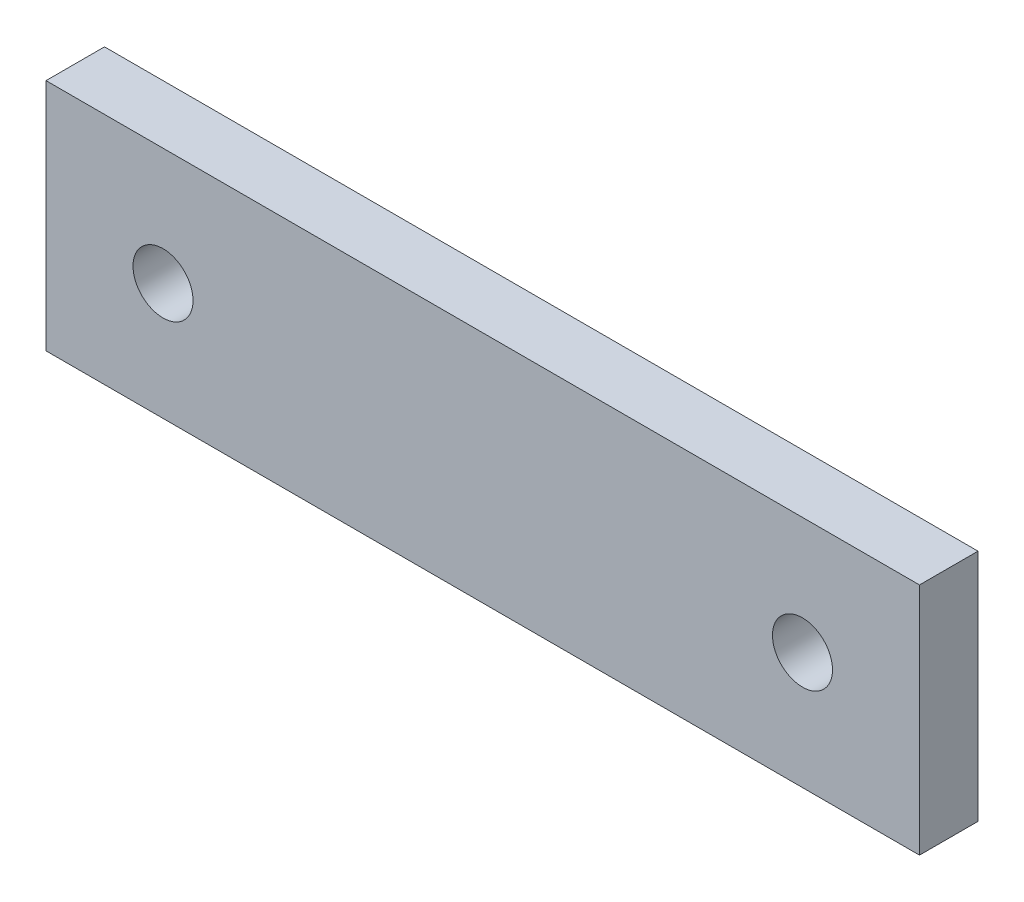
ISO-10303-21;
HEADER;
FILE_DESCRIPTION(('STEP AP214'),'2;1');
FILE_NAME('part.step','',(''),(''),'','','');
FILE_SCHEMA(('AUTOMOTIVE_DESIGN { 1 0 10303 214 1 1 1 1 }'));
ENDSEC;
DATA;
#1=APPLICATION_CONTEXT('core data for automotive mechanical design processes');
#2=APPLICATION_PROTOCOL_DEFINITION('international standard','automotive_design',2000,#1);
#3=PRODUCT_CONTEXT('',#1,'mechanical');
#4=PRODUCT('Part','Part','',(#3));
#5=PRODUCT_RELATED_PRODUCT_CATEGORY('part','',(#4));
#6=PRODUCT_DEFINITION_FORMATION('','',#4);
#7=PRODUCT_DEFINITION_CONTEXT('part definition',#1,'design');
#8=PRODUCT_DEFINITION('design','',#6,#7);
#9=PRODUCT_DEFINITION_SHAPE('','',#8);
#10=(LENGTH_UNIT() NAMED_UNIT(*) SI_UNIT(.MILLI.,.METRE.));
#11=(NAMED_UNIT(*) PLANE_ANGLE_UNIT() SI_UNIT($,.RADIAN.));
#12=(NAMED_UNIT(*) SI_UNIT($,.STERADIAN.) SOLID_ANGLE_UNIT());
#13=UNCERTAINTY_MEASURE_WITH_UNIT(LENGTH_MEASURE(1.E-05),#10,'distance_accuracy_value','');
#14=(GEOMETRIC_REPRESENTATION_CONTEXT(3) GLOBAL_UNCERTAINTY_ASSIGNED_CONTEXT((#13)) GLOBAL_UNIT_ASSIGNED_CONTEXT((#10,
#11,#12)) REPRESENTATION_CONTEXT('',''));
#15=CARTESIAN_POINT('',(0.,0.,0.));
#16=DIRECTION('',(0.,0.,1.));
#17=DIRECTION('',(1.,0.,0.));
#18=AXIS2_PLACEMENT_3D('',#15,#16,#17);
#19=CARTESIAN_POINT('',(0.,0.,6.35));
#20=DIRECTION('',(0.,0.,-1.));
#21=DIRECTION('',(-1.,0.,0.));
#22=AXIS2_PLACEMENT_3D('',#19,#20,#21);
#23=PLANE('',#22);
#24=DIRECTION('',(0.,1.,0.));
#25=VECTOR('',#24,1.);
#26=CARTESIAN_POINT('',(47.4,-12.7,6.35));
#27=LINE('',#26,#25);
#28=CARTESIAN_POINT('',(47.4,-12.7,6.35));
#29=VERTEX_POINT('',#28);
#30=CARTESIAN_POINT('',(47.4,12.7,6.35));
#31=VERTEX_POINT('',#30);
#32=EDGE_CURVE('E102',#29,#31,#27,.T.);
#33=ORIENTED_EDGE('',*,*,#32,.T.);
#34=DIRECTION('',(-1.,0.,0.));
#35=VECTOR('',#34,1.);
#36=CARTESIAN_POINT('',(-47.4,12.7,6.35));
#37=LINE('',#36,#35);
#38=CARTESIAN_POINT('',(-47.4,12.7,6.35));
#39=VERTEX_POINT('',#38);
#40=EDGE_CURVE('E97',#31,#39,#37,.T.);
#41=ORIENTED_EDGE('',*,*,#40,.T.);
#42=DIRECTION('',(0.,-1.,0.));
#43=VECTOR('',#42,1.);
#44=CARTESIAN_POINT('',(-47.4,-12.7,6.35));
#45=LINE('',#44,#43);
#46=CARTESIAN_POINT('',(-47.4,-12.7,6.35));
#47=VERTEX_POINT('',#46);
#48=EDGE_CURVE('E100',#39,#47,#45,.T.);
#49=ORIENTED_EDGE('',*,*,#48,.T.);
#50=DIRECTION('',(1.,0.,0.));
#51=VECTOR('',#50,1.);
#52=CARTESIAN_POINT('',(-47.4,-12.7,6.35));
#53=LINE('',#52,#51);
#54=EDGE_CURVE('E67',#47,#29,#53,.T.);
#55=ORIENTED_EDGE('',*,*,#54,.T.);
#56=EDGE_LOOP('',(#33,#41,#49,#55));
#57=FACE_BOUND('',#56,.T.);
#58=CARTESIAN_POINT('',(34.7,0.,6.35));
#59=DIRECTION('',(0.,0.,1.));
#60=DIRECTION('',(1.,0.,0.));
#61=AXIS2_PLACEMENT_3D('',#58,#59,#60);
#62=CIRCLE('',#61,3.25755);
#63=CARTESIAN_POINT('',(37.95755,0.,6.35));
#64=VERTEX_POINT('',#63);
#65=EDGE_CURVE('E123',#64,#64,#62,.T.);
#66=ORIENTED_EDGE('',*,*,#65,.F.);
#67=EDGE_LOOP('',(#66));
#68=FACE_BOUND('',#67,.T.);
#69=CARTESIAN_POINT('',(-34.7,0.,6.35));
#70=DIRECTION('',(0.,0.,1.));
#71=DIRECTION('',(1.,0.,0.));
#72=AXIS2_PLACEMENT_3D('',#69,#70,#71);
#73=CIRCLE('',#72,3.25755);
#74=CARTESIAN_POINT('',(-31.44245,0.,6.35));
#75=VERTEX_POINT('',#74);
#76=EDGE_CURVE('E147',#75,#75,#73,.T.);
#77=ORIENTED_EDGE('',*,*,#76,.F.);
#78=EDGE_LOOP('',(#77));
#79=FACE_BOUND('',#78,.T.);
#80=ADVANCED_FACE('F49',(#57,#68,#79),#23,.F.);
#81=CARTESIAN_POINT('',(0.,0.,0.));
#82=DIRECTION('',(0.,0.,-1.));
#83=DIRECTION('',(-1.,0.,0.));
#84=AXIS2_PLACEMENT_3D('',#81,#82,#83);
#85=PLANE('',#84);
#86=CARTESIAN_POINT('',(34.7,0.,0.));
#87=DIRECTION('',(0.,0.,1.));
#88=DIRECTION('',(1.,0.,0.));
#89=AXIS2_PLACEMENT_3D('',#86,#87,#88);
#90=CIRCLE('',#89,3.25755);
#91=CARTESIAN_POINT('',(37.95755,0.,0.));
#92=VERTEX_POINT('',#91);
#93=EDGE_CURVE('E144',#92,#92,#90,.T.);
#94=ORIENTED_EDGE('',*,*,#93,.T.);
#95=EDGE_LOOP('',(#94));
#96=FACE_BOUND('',#95,.T.);
#97=DIRECTION('',(0.,1.,0.));
#98=VECTOR('',#97,1.);
#99=CARTESIAN_POINT('',(47.4,-12.7,0.));
#100=LINE('',#99,#98);
#101=CARTESIAN_POINT('',(47.4,-12.7,0.));
#102=VERTEX_POINT('',#101);
#103=CARTESIAN_POINT('',(47.4,12.7,0.));
#104=VERTEX_POINT('',#103);
#105=EDGE_CURVE('E119',#102,#104,#100,.T.);
#106=ORIENTED_EDGE('',*,*,#105,.F.);
#107=DIRECTION('',(1.,0.,0.));
#108=VECTOR('',#107,1.);
#109=CARTESIAN_POINT('',(-47.4,-12.7,0.));
#110=LINE('',#109,#108);
#111=CARTESIAN_POINT('',(-47.4,-12.7,0.));
#112=VERTEX_POINT('',#111);
#113=EDGE_CURVE('E90',#112,#102,#110,.T.);
#114=ORIENTED_EDGE('',*,*,#113,.F.);
#115=DIRECTION('',(0.,-1.,0.));
#116=VECTOR('',#115,1.);
#117=CARTESIAN_POINT('',(-47.4,-12.7,0.));
#118=LINE('',#117,#116);
#119=CARTESIAN_POINT('',(-47.4,12.7,0.));
#120=VERTEX_POINT('',#119);
#121=EDGE_CURVE('E84',#120,#112,#118,.T.);
#122=ORIENTED_EDGE('',*,*,#121,.F.);
#123=DIRECTION('',(-1.,0.,0.));
#124=VECTOR('',#123,1.);
#125=CARTESIAN_POINT('',(-47.4,12.7,0.));
#126=LINE('',#125,#124);
#127=EDGE_CURVE('E107',#104,#120,#126,.T.);
#128=ORIENTED_EDGE('',*,*,#127,.F.);
#129=EDGE_LOOP('',(#106,#114,#122,#128));
#130=FACE_BOUND('',#129,.T.);
#131=CARTESIAN_POINT('',(-34.7,0.,0.));
#132=DIRECTION('',(0.,0.,1.));
#133=DIRECTION('',(1.,0.,0.));
#134=AXIS2_PLACEMENT_3D('',#131,#132,#133);
#135=CIRCLE('',#134,3.25755);
#136=CARTESIAN_POINT('',(-31.44245,0.,0.));
#137=VERTEX_POINT('',#136);
#138=EDGE_CURVE('E151',#137,#137,#135,.T.);
#139=ORIENTED_EDGE('',*,*,#138,.T.);
#140=EDGE_LOOP('',(#139));
#141=FACE_BOUND('',#140,.T.);
#142=ADVANCED_FACE('F138',(#96,#130,#141),#85,.T.);
#143=CARTESIAN_POINT('',(47.4,-12.7,6.35));
#144=DIRECTION('',(-1.,0.,0.));
#145=DIRECTION('',(0.,0.,1.));
#146=AXIS2_PLACEMENT_3D('',#143,#144,#145);
#147=PLANE('',#146);
#148=ORIENTED_EDGE('',*,*,#105,.T.);
#149=DIRECTION('',(0.,0.,-1.));
#150=VECTOR('',#149,1.);
#151=CARTESIAN_POINT('',(47.4,12.7,6.35));
#152=LINE('',#151,#150);
#153=EDGE_CURVE('E11',#31,#104,#152,.T.);
#154=ORIENTED_EDGE('',*,*,#153,.F.);
#155=ORIENTED_EDGE('',*,*,#32,.F.);
#156=DIRECTION('',(0.,0.,-1.));
#157=VECTOR('',#156,1.);
#158=CARTESIAN_POINT('',(47.4,-12.7,6.35));
#159=LINE('',#158,#157);
#160=EDGE_CURVE('E115',#29,#102,#159,.T.);
#161=ORIENTED_EDGE('',*,*,#160,.T.);
#162=EDGE_LOOP('',(#148,#154,#155,#161));
#163=FACE_BOUND('',#162,.T.);
#164=ADVANCED_FACE('F51',(#163),#147,.F.);
#165=CARTESIAN_POINT('',(-47.4,12.7,6.35));
#166=DIRECTION('',(0.,-1.,0.));
#167=DIRECTION('',(0.,0.,-1.));
#168=AXIS2_PLACEMENT_3D('',#165,#166,#167);
#169=PLANE('',#168);
#170=ORIENTED_EDGE('',*,*,#127,.T.);
#171=DIRECTION('',(0.,0.,-1.));
#172=VECTOR('',#171,1.);
#173=CARTESIAN_POINT('',(-47.4,12.7,6.35));
#174=LINE('',#173,#172);
#175=EDGE_CURVE('E59',#39,#120,#174,.T.);
#176=ORIENTED_EDGE('',*,*,#175,.F.);
#177=ORIENTED_EDGE('',*,*,#40,.F.);
#178=ORIENTED_EDGE('',*,*,#153,.T.);
#179=EDGE_LOOP('',(#170,#176,#177,#178));
#180=FACE_BOUND('',#179,.T.);
#181=ADVANCED_FACE('F106',(#180),#169,.F.);
#182=CARTESIAN_POINT('',(-47.4,-12.7,6.35));
#183=DIRECTION('',(1.,0.,0.));
#184=DIRECTION('',(0.,0.,-1.));
#185=AXIS2_PLACEMENT_3D('',#182,#183,#184);
#186=PLANE('',#185);
#187=ORIENTED_EDGE('',*,*,#121,.T.);
#188=DIRECTION('',(0.,0.,-1.));
#189=VECTOR('',#188,1.);
#190=CARTESIAN_POINT('',(-47.4,-12.7,6.35));
#191=LINE('',#190,#189);
#192=EDGE_CURVE('E109',#47,#112,#191,.T.);
#193=ORIENTED_EDGE('',*,*,#192,.F.);
#194=ORIENTED_EDGE('',*,*,#48,.F.);
#195=ORIENTED_EDGE('',*,*,#175,.T.);
#196=EDGE_LOOP('',(#187,#193,#194,#195));
#197=FACE_BOUND('',#196,.T.);
#198=ADVANCED_FACE('F110',(#197),#186,.F.);
#199=CARTESIAN_POINT('',(-47.4,-12.7,6.35));
#200=DIRECTION('',(0.,1.,0.));
#201=DIRECTION('',(-1.,0.,0.));
#202=AXIS2_PLACEMENT_3D('',#199,#200,#201);
#203=PLANE('',#202);
#204=ORIENTED_EDGE('',*,*,#113,.T.);
#205=ORIENTED_EDGE('',*,*,#160,.F.);
#206=ORIENTED_EDGE('',*,*,#54,.F.);
#207=ORIENTED_EDGE('',*,*,#192,.T.);
#208=EDGE_LOOP('',(#204,#205,#206,#207));
#209=FACE_BOUND('',#208,.T.);
#210=ADVANCED_FACE('F135',(#209),#203,.F.);
#211=CARTESIAN_POINT('',(34.7,0.,6.35));
#212=DIRECTION('',(0.,0.,-1.));
#213=DIRECTION('',(-1.,0.,0.));
#214=AXIS2_PLACEMENT_3D('',#211,#212,#213);
#215=CYLINDRICAL_SURFACE('',#214,3.25755);
#216=ORIENTED_EDGE('',*,*,#65,.T.);
#217=EDGE_LOOP('',(#216));
#218=FACE_BOUND('',#217,.T.);
#219=ORIENTED_EDGE('',*,*,#93,.F.);
#220=EDGE_LOOP('',(#219));
#221=FACE_BOUND('',#220,.T.);
#222=ADVANCED_FACE('F170',(#218,#221),#215,.F.);
#223=CARTESIAN_POINT('',(-34.7,0.,6.35));
#224=DIRECTION('',(0.,0.,-1.));
#225=DIRECTION('',(-1.,0.,0.));
#226=AXIS2_PLACEMENT_3D('',#223,#224,#225);
#227=CYLINDRICAL_SURFACE('',#226,3.25755);
#228=ORIENTED_EDGE('',*,*,#76,.T.);
#229=EDGE_LOOP('',(#228));
#230=FACE_BOUND('',#229,.T.);
#231=ORIENTED_EDGE('',*,*,#138,.F.);
#232=EDGE_LOOP('',(#231));
#233=FACE_BOUND('',#232,.T.);
#234=ADVANCED_FACE('F160',(#230,#233),#227,.F.);
#235=CLOSED_SHELL('',(#80,#142,#164,#181,#198,#210,#222,#234));
#236=MANIFOLD_SOLID_BREP('B2',#235);
#237=ADVANCED_BREP_SHAPE_REPRESENTATION('',(#18,#236),#14);
#238=SHAPE_DEFINITION_REPRESENTATION(#9,#237);
ENDSEC;
END-ISO-10303-21;
